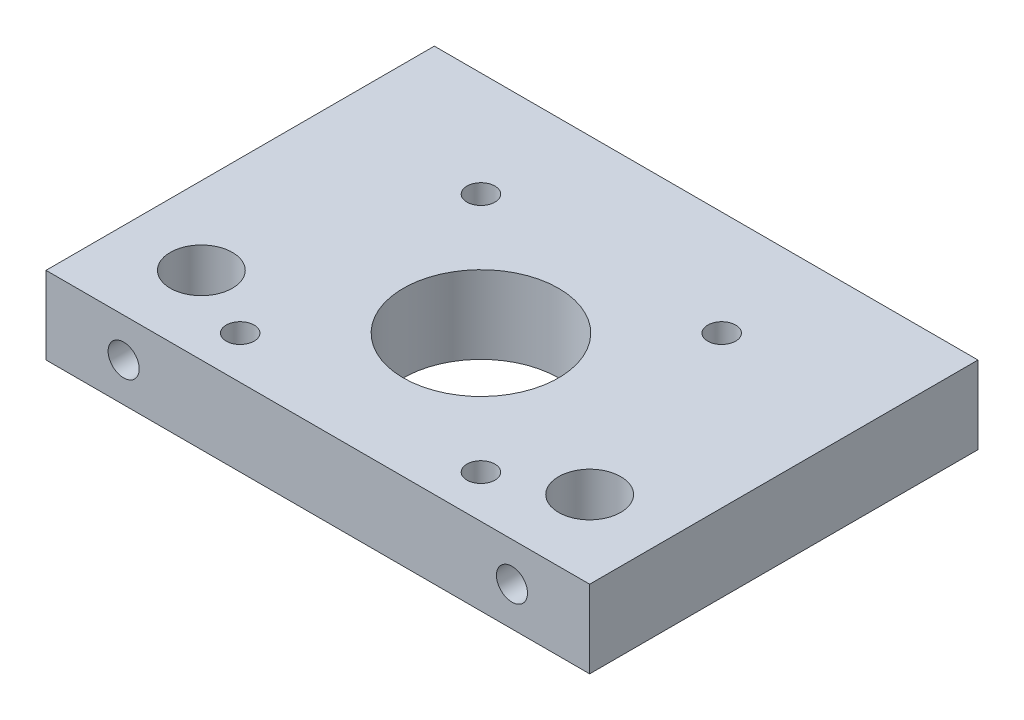
ISO-10303-21;
HEADER;
FILE_DESCRIPTION(('STEP AP214'),'2;1');
FILE_NAME('part.step','',(''),(''),'','','');
FILE_SCHEMA(('AUTOMOTIVE_DESIGN { 1 0 10303 214 1 1 1 1 }'));
ENDSEC;
DATA;
#1=APPLICATION_CONTEXT('core data for automotive mechanical design processes');
#2=APPLICATION_PROTOCOL_DEFINITION('international standard','automotive_design',2000,#1);
#3=PRODUCT_CONTEXT('',#1,'mechanical');
#4=PRODUCT('Part','Part','',(#3));
#5=PRODUCT_RELATED_PRODUCT_CATEGORY('part','',(#4));
#6=PRODUCT_DEFINITION_FORMATION('','',#4);
#7=PRODUCT_DEFINITION_CONTEXT('part definition',#1,'design');
#8=PRODUCT_DEFINITION('design','',#6,#7);
#9=PRODUCT_DEFINITION_SHAPE('','',#8);
#10=(LENGTH_UNIT() NAMED_UNIT(*) SI_UNIT(.MILLI.,.METRE.));
#11=(NAMED_UNIT(*) PLANE_ANGLE_UNIT() SI_UNIT($,.RADIAN.));
#12=(NAMED_UNIT(*) SI_UNIT($,.STERADIAN.) SOLID_ANGLE_UNIT());
#13=UNCERTAINTY_MEASURE_WITH_UNIT(LENGTH_MEASURE(1.E-05),#10,'distance_accuracy_value','');
#14=(GEOMETRIC_REPRESENTATION_CONTEXT(3) GLOBAL_UNCERTAINTY_ASSIGNED_CONTEXT((#13)) GLOBAL_UNIT_ASSIGNED_CONTEXT((#10,
#11,#12)) REPRESENTATION_CONTEXT('',''));
#15=CARTESIAN_POINT('',(0.,0.,0.));
#16=DIRECTION('',(0.,0.,1.));
#17=DIRECTION('',(1.,0.,0.));
#18=AXIS2_PLACEMENT_3D('',#15,#16,#17);
#19=CARTESIAN_POINT('',(-35.,10.,25.));
#20=DIRECTION('',(1.,0.,0.));
#21=DIRECTION('',(0.,0.,-1.));
#22=AXIS2_PLACEMENT_3D('',#19,#20,#21);
#23=PLANE('',#22);
#24=DIRECTION('',(0.,0.,1.));
#25=VECTOR('',#24,1.);
#26=CARTESIAN_POINT('',(-35.,0.,25.));
#27=LINE('',#26,#25);
#28=CARTESIAN_POINT('',(-35.,0.,-25.));
#29=VERTEX_POINT('',#28);
#30=CARTESIAN_POINT('',(-35.,0.,25.));
#31=VERTEX_POINT('',#30);
#32=EDGE_CURVE('E108',#29,#31,#27,.T.);
#33=ORIENTED_EDGE('',*,*,#32,.T.);
#34=DIRECTION('',(0.,-1.,0.));
#35=VECTOR('',#34,1.);
#36=CARTESIAN_POINT('',(-35.,10.,25.));
#37=LINE('',#36,#35);
#38=CARTESIAN_POINT('',(-35.,10.,25.));
#39=VERTEX_POINT('',#38);
#40=EDGE_CURVE('E11',#39,#31,#37,.T.);
#41=ORIENTED_EDGE('',*,*,#40,.F.);
#42=DIRECTION('',(0.,0.,1.));
#43=VECTOR('',#42,1.);
#44=CARTESIAN_POINT('',(-35.,10.,25.));
#45=LINE('',#44,#43);
#46=CARTESIAN_POINT('',(-35.,10.,-25.));
#47=VERTEX_POINT('',#46);
#48=EDGE_CURVE('E95',#47,#39,#45,.T.);
#49=ORIENTED_EDGE('',*,*,#48,.F.);
#50=DIRECTION('',(0.,-1.,0.));
#51=VECTOR('',#50,1.);
#52=CARTESIAN_POINT('',(-35.,10.,-25.));
#53=LINE('',#52,#51);
#54=EDGE_CURVE('E104',#47,#29,#53,.T.);
#55=ORIENTED_EDGE('',*,*,#54,.T.);
#56=EDGE_LOOP('',(#33,#41,#49,#55));
#57=FACE_BOUND('',#56,.T.);
#58=ADVANCED_FACE('F37',(#57),#23,.F.);
#59=CARTESIAN_POINT('',(35.,10.,25.));
#60=DIRECTION('',(0.,0.,-1.));
#61=DIRECTION('',(-1.,0.,0.));
#62=AXIS2_PLACEMENT_3D('',#59,#60,#61);
#63=PLANE('',#62);
#64=CARTESIAN_POINT('',(25.,5.,25.));
#65=DIRECTION('',(0.,0.,1.));
#66=DIRECTION('',(1.,0.,0.));
#67=AXIS2_PLACEMENT_3D('',#64,#65,#66);
#68=CIRCLE('',#67,2.);
#69=CARTESIAN_POINT('',(27.,5.,25.));
#70=VERTEX_POINT('',#69);
#71=EDGE_CURVE('E123',#70,#70,#68,.T.);
#72=ORIENTED_EDGE('',*,*,#71,.F.);
#73=EDGE_LOOP('',(#72));
#74=FACE_BOUND('',#73,.T.);
#75=CARTESIAN_POINT('',(-25.,4.99999999999999,25.));
#76=DIRECTION('',(0.,0.,1.));
#77=DIRECTION('',(-1.,0.,0.));
#78=AXIS2_PLACEMENT_3D('',#75,#76,#77);
#79=CIRCLE('',#78,2.);
#80=CARTESIAN_POINT('',(-27.,4.99999999999999,25.));
#81=VERTEX_POINT('',#80);
#82=EDGE_CURVE('E324',#81,#81,#79,.T.);
#83=ORIENTED_EDGE('',*,*,#82,.F.);
#84=EDGE_LOOP('',(#83));
#85=FACE_BOUND('',#84,.T.);
#86=DIRECTION('',(1.,0.,0.));
#87=VECTOR('',#86,1.);
#88=CARTESIAN_POINT('',(35.,0.,25.));
#89=LINE('',#88,#87);
#90=CARTESIAN_POINT('',(35.,0.,25.));
#91=VERTEX_POINT('',#90);
#92=EDGE_CURVE('E99',#31,#91,#89,.T.);
#93=ORIENTED_EDGE('',*,*,#92,.T.);
#94=DIRECTION('',(0.,-1.,0.));
#95=VECTOR('',#94,1.);
#96=CARTESIAN_POINT('',(35.,10.,25.));
#97=LINE('',#96,#95);
#98=CARTESIAN_POINT('',(35.,10.,25.));
#99=VERTEX_POINT('',#98);
#100=EDGE_CURVE('E51',#99,#91,#97,.T.);
#101=ORIENTED_EDGE('',*,*,#100,.F.);
#102=DIRECTION('',(1.,0.,0.));
#103=VECTOR('',#102,1.);
#104=CARTESIAN_POINT('',(35.,10.,25.));
#105=LINE('',#104,#103);
#106=EDGE_CURVE('E90',#39,#99,#105,.T.);
#107=ORIENTED_EDGE('',*,*,#106,.F.);
#108=ORIENTED_EDGE('',*,*,#40,.T.);
#109=EDGE_LOOP('',(#93,#101,#107,#108));
#110=FACE_BOUND('',#109,.T.);
#111=ADVANCED_FACE('F98',(#74,#85,#110),#63,.F.);
#112=CARTESIAN_POINT('',(35.,10.,25.));
#113=DIRECTION('',(-1.,0.,0.));
#114=DIRECTION('',(0.,0.,1.));
#115=AXIS2_PLACEMENT_3D('',#112,#113,#114);
#116=PLANE('',#115);
#117=DIRECTION('',(0.,0.,-1.));
#118=VECTOR('',#117,1.);
#119=CARTESIAN_POINT('',(35.,0.,25.));
#120=LINE('',#119,#118);
#121=CARTESIAN_POINT('',(35.,0.,-25.));
#122=VERTEX_POINT('',#121);
#123=EDGE_CURVE('E77',#91,#122,#120,.T.);
#124=ORIENTED_EDGE('',*,*,#123,.T.);
#125=DIRECTION('',(0.,-1.,0.));
#126=VECTOR('',#125,1.);
#127=CARTESIAN_POINT('',(35.,10.,-25.));
#128=LINE('',#127,#126);
#129=CARTESIAN_POINT('',(35.,10.,-25.));
#130=VERTEX_POINT('',#129);
#131=EDGE_CURVE('E100',#130,#122,#128,.T.);
#132=ORIENTED_EDGE('',*,*,#131,.F.);
#133=DIRECTION('',(0.,0.,-1.));
#134=VECTOR('',#133,1.);
#135=CARTESIAN_POINT('',(35.,10.,25.));
#136=LINE('',#135,#134);
#137=EDGE_CURVE('E93',#99,#130,#136,.T.);
#138=ORIENTED_EDGE('',*,*,#137,.F.);
#139=ORIENTED_EDGE('',*,*,#100,.T.);
#140=EDGE_LOOP('',(#124,#132,#138,#139));
#141=FACE_BOUND('',#140,.T.);
#142=ADVANCED_FACE('F102',(#141),#116,.F.);
#143=CARTESIAN_POINT('',(35.,10.,-25.));
#144=DIRECTION('',(0.,0.,1.));
#145=DIRECTION('',(1.,0.,0.));
#146=AXIS2_PLACEMENT_3D('',#143,#144,#145);
#147=PLANE('',#146);
#148=DIRECTION('',(-1.,0.,0.));
#149=VECTOR('',#148,1.);
#150=CARTESIAN_POINT('',(35.,0.,-25.));
#151=LINE('',#150,#149);
#152=EDGE_CURVE('E83',#122,#29,#151,.T.);
#153=ORIENTED_EDGE('',*,*,#152,.T.);
#154=ORIENTED_EDGE('',*,*,#54,.F.);
#155=DIRECTION('',(-1.,0.,0.));
#156=VECTOR('',#155,1.);
#157=CARTESIAN_POINT('',(35.,10.,-25.));
#158=LINE('',#157,#156);
#159=EDGE_CURVE('E60',#130,#47,#158,.T.);
#160=ORIENTED_EDGE('',*,*,#159,.F.);
#161=ORIENTED_EDGE('',*,*,#131,.T.);
#162=EDGE_LOOP('',(#153,#154,#160,#161));
#163=FACE_BOUND('',#162,.T.);
#164=ADVANCED_FACE('F176',(#163),#147,.F.);
#165=CARTESIAN_POINT('',(0.,10.,0.));
#166=DIRECTION('',(0.,1.,0.));
#167=DIRECTION('',(0.,0.,1.));
#168=AXIS2_PLACEMENT_3D('',#165,#166,#167);
#169=PLANE('',#168);
#170=CARTESIAN_POINT('',(5.15281762734335E-13,10.,4.));
#171=DIRECTION('',(0.,-1.,0.));
#172=DIRECTION('',(0.,0.,-1.));
#173=AXIS2_PLACEMENT_3D('',#170,#171,#172);
#174=CIRCLE('',#173,10.);
#175=CARTESIAN_POINT('',(5.15281762734335E-13,10.,-6.00000000000001));
#176=VERTEX_POINT('',#175);
#177=EDGE_CURVE('E254',#176,#176,#174,.T.);
#178=ORIENTED_EDGE('',*,*,#177,.T.);
#179=EDGE_LOOP('',(#178));
#180=FACE_BOUND('',#179,.T.);
#181=CARTESIAN_POINT('',(15.5000000000005,10.,19.5));
#182=DIRECTION('',(0.,-1.,0.));
#183=DIRECTION('',(0.,0.,-1.));
#184=AXIS2_PLACEMENT_3D('',#181,#182,#183);
#185=CIRCLE('',#184,1.80000000000002);
#186=CARTESIAN_POINT('',(15.5000000000005,10.,17.7));
#187=VERTEX_POINT('',#186);
#188=EDGE_CURVE('E275',#187,#187,#185,.T.);
#189=ORIENTED_EDGE('',*,*,#188,.T.);
#190=EDGE_LOOP('',(#189));
#191=FACE_BOUND('',#190,.T.);
#192=CARTESIAN_POINT('',(15.5000000000005,10.,-11.5));
#193=DIRECTION('',(0.,-1.,0.));
#194=DIRECTION('',(0.,0.,-1.));
#195=AXIS2_PLACEMENT_3D('',#192,#193,#194);
#196=CIRCLE('',#195,1.80000000000002);
#197=CARTESIAN_POINT('',(15.5000000000005,10.,-13.3));
#198=VERTEX_POINT('',#197);
#199=EDGE_CURVE('E269',#198,#198,#196,.T.);
#200=ORIENTED_EDGE('',*,*,#199,.T.);
#201=EDGE_LOOP('',(#200));
#202=FACE_BOUND('',#201,.T.);
#203=CARTESIAN_POINT('',(-15.4999999999995,10.,-11.5));
#204=DIRECTION('',(0.,-1.,0.));
#205=DIRECTION('',(0.,0.,-1.));
#206=AXIS2_PLACEMENT_3D('',#203,#204,#205);
#207=CIRCLE('',#206,1.80000000000002);
#208=CARTESIAN_POINT('',(-15.4999999999995,10.,-13.3));
#209=VERTEX_POINT('',#208);
#210=EDGE_CURVE('E262',#209,#209,#207,.T.);
#211=ORIENTED_EDGE('',*,*,#210,.T.);
#212=EDGE_LOOP('',(#211));
#213=FACE_BOUND('',#212,.T.);
#214=CARTESIAN_POINT('',(-15.4999999999995,10.,19.5));
#215=DIRECTION('',(0.,-1.,0.));
#216=DIRECTION('',(0.,0.,-1.));
#217=AXIS2_PLACEMENT_3D('',#214,#215,#216);
#218=CIRCLE('',#217,1.80000000000002);
#219=CARTESIAN_POINT('',(-15.4999999999995,10.,17.7));
#220=VERTEX_POINT('',#219);
#221=EDGE_CURVE('E280',#220,#220,#218,.T.);
#222=ORIENTED_EDGE('',*,*,#221,.T.);
#223=EDGE_LOOP('',(#222));
#224=FACE_BOUND('',#223,.T.);
#225=CARTESIAN_POINT('',(-25.,10.,15.));
#226=DIRECTION('',(0.,1.,0.));
#227=DIRECTION('',(0.,0.,1.));
#228=AXIS2_PLACEMENT_3D('',#225,#226,#227);
#229=CIRCLE('',#228,4.);
#230=CARTESIAN_POINT('',(-25.,10.,19.));
#231=VERTEX_POINT('',#230);
#232=EDGE_CURVE('E288',#231,#231,#229,.T.);
#233=ORIENTED_EDGE('',*,*,#232,.F.);
#234=EDGE_LOOP('',(#233));
#235=FACE_BOUND('',#234,.T.);
#236=CARTESIAN_POINT('',(25.,10.,15.));
#237=DIRECTION('',(0.,1.,0.));
#238=DIRECTION('',(0.,0.,-1.));
#239=AXIS2_PLACEMENT_3D('',#236,#237,#238);
#240=CIRCLE('',#239,4.);
#241=CARTESIAN_POINT('',(25.,10.,11.));
#242=VERTEX_POINT('',#241);
#243=EDGE_CURVE('E283',#242,#242,#240,.T.);
#244=ORIENTED_EDGE('',*,*,#243,.F.);
#245=EDGE_LOOP('',(#244));
#246=FACE_BOUND('',#245,.T.);
#247=ORIENTED_EDGE('',*,*,#48,.T.);
#248=ORIENTED_EDGE('',*,*,#106,.T.);
#249=ORIENTED_EDGE('',*,*,#137,.T.);
#250=ORIENTED_EDGE('',*,*,#159,.T.);
#251=EDGE_LOOP('',(#247,#248,#249,#250));
#252=FACE_BOUND('',#251,.T.);
#253=ADVANCED_FACE('F91',(#180,#191,#202,#213,#224,#235,#246,#252),#169,.T.);
#254=CARTESIAN_POINT('',(0.,0.,0.));
#255=DIRECTION('',(0.,1.,0.));
#256=DIRECTION('',(0.,0.,1.));
#257=AXIS2_PLACEMENT_3D('',#254,#255,#256);
#258=PLANE('',#257);
#259=CARTESIAN_POINT('',(5.15281762734335E-13,0.,4.));
#260=DIRECTION('',(0.,-1.,0.));
#261=DIRECTION('',(0.,0.,-1.));
#262=AXIS2_PLACEMENT_3D('',#259,#260,#261);
#263=CIRCLE('',#262,10.);
#264=CARTESIAN_POINT('',(5.15281762734335E-13,0.,-6.00000000000001));
#265=VERTEX_POINT('',#264);
#266=EDGE_CURVE('E252',#265,#265,#263,.T.);
#267=ORIENTED_EDGE('',*,*,#266,.F.);
#268=EDGE_LOOP('',(#267));
#269=FACE_BOUND('',#268,.T.);
#270=CARTESIAN_POINT('',(15.5000000000005,0.,19.5));
#271=DIRECTION('',(0.,-1.,0.));
#272=DIRECTION('',(0.,0.,-1.));
#273=AXIS2_PLACEMENT_3D('',#270,#271,#272);
#274=CIRCLE('',#273,1.80000000000002);
#275=CARTESIAN_POINT('',(15.5000000000005,0.,17.7));
#276=VERTEX_POINT('',#275);
#277=EDGE_CURVE('E258',#276,#276,#274,.T.);
#278=ORIENTED_EDGE('',*,*,#277,.F.);
#279=EDGE_LOOP('',(#278));
#280=FACE_BOUND('',#279,.T.);
#281=CARTESIAN_POINT('',(15.5000000000005,0.,-11.5));
#282=DIRECTION('',(0.,-1.,0.));
#283=DIRECTION('',(0.,0.,-1.));
#284=AXIS2_PLACEMENT_3D('',#281,#282,#283);
#285=CIRCLE('',#284,1.80000000000002);
#286=CARTESIAN_POINT('',(15.5000000000005,0.,-13.3));
#287=VERTEX_POINT('',#286);
#288=EDGE_CURVE('E272',#287,#287,#285,.T.);
#289=ORIENTED_EDGE('',*,*,#288,.F.);
#290=EDGE_LOOP('',(#289));
#291=FACE_BOUND('',#290,.T.);
#292=CARTESIAN_POINT('',(-15.4999999999995,0.,-11.5));
#293=DIRECTION('',(0.,-1.,0.));
#294=DIRECTION('',(0.,0.,-1.));
#295=AXIS2_PLACEMENT_3D('',#292,#293,#294);
#296=CIRCLE('',#295,1.80000000000002);
#297=CARTESIAN_POINT('',(-15.4999999999995,0.,-13.3));
#298=VERTEX_POINT('',#297);
#299=EDGE_CURVE('E266',#298,#298,#296,.T.);
#300=ORIENTED_EDGE('',*,*,#299,.F.);
#301=EDGE_LOOP('',(#300));
#302=FACE_BOUND('',#301,.T.);
#303=CARTESIAN_POINT('',(-15.4999999999995,0.,19.5));
#304=DIRECTION('',(0.,-1.,0.));
#305=DIRECTION('',(0.,0.,-1.));
#306=AXIS2_PLACEMENT_3D('',#303,#304,#305);
#307=CIRCLE('',#306,1.80000000000002);
#308=CARTESIAN_POINT('',(-15.4999999999995,0.,17.7));
#309=VERTEX_POINT('',#308);
#310=EDGE_CURVE('E265',#309,#309,#307,.T.);
#311=ORIENTED_EDGE('',*,*,#310,.F.);
#312=EDGE_LOOP('',(#311));
#313=FACE_BOUND('',#312,.T.);
#314=CARTESIAN_POINT('',(-25.,0.,15.));
#315=DIRECTION('',(0.,1.,0.));
#316=DIRECTION('',(0.,0.,1.));
#317=AXIS2_PLACEMENT_3D('',#314,#315,#316);
#318=CIRCLE('',#317,4.);
#319=CARTESIAN_POINT('',(-25.,0.,19.));
#320=VERTEX_POINT('',#319);
#321=EDGE_CURVE('E111',#320,#320,#318,.T.);
#322=ORIENTED_EDGE('',*,*,#321,.T.);
#323=EDGE_LOOP('',(#322));
#324=FACE_BOUND('',#323,.T.);
#325=CARTESIAN_POINT('',(25.,0.,15.));
#326=DIRECTION('',(0.,1.,0.));
#327=DIRECTION('',(0.,0.,-1.));
#328=AXIS2_PLACEMENT_3D('',#325,#326,#327);
#329=CIRCLE('',#328,4.);
#330=CARTESIAN_POINT('',(25.,0.,11.));
#331=VERTEX_POINT('',#330);
#332=EDGE_CURVE('E291',#331,#331,#329,.T.);
#333=ORIENTED_EDGE('',*,*,#332,.T.);
#334=EDGE_LOOP('',(#333));
#335=FACE_BOUND('',#334,.T.);
#336=ORIENTED_EDGE('',*,*,#32,.F.);
#337=ORIENTED_EDGE('',*,*,#152,.F.);
#338=ORIENTED_EDGE('',*,*,#123,.F.);
#339=ORIENTED_EDGE('',*,*,#92,.F.);
#340=EDGE_LOOP('',(#336,#337,#338,#339));
#341=FACE_BOUND('',#340,.T.);
#342=ADVANCED_FACE('F167',(#269,#280,#291,#302,#313,#324,#335,#341),#258,.F.);
#343=CARTESIAN_POINT('',(25.,0.,15.));
#344=DIRECTION('',(0.,1.,0.));
#345=DIRECTION('',(0.,0.,1.));
#346=AXIS2_PLACEMENT_3D('',#343,#344,#345);
#347=CYLINDRICAL_SURFACE('',#346,4.);
#348=CARTESIAN_POINT('',(25.,3.,19.));
#349=CARTESIAN_POINT('',(25.1051439259025,3.00000660463439,18.9999942681008));
#350=CARTESIAN_POINT('',(25.2104131993951,3.00834014624211,18.9958098203951));
#351=CARTESIAN_POINT('',(25.4178404705378,3.04130576068308,18.9794831207431));
#352=CARTESIAN_POINT('',(25.5199921734273,3.06596878599564,18.9673257565784));
#353=CARTESIAN_POINT('',(25.7178670897609,3.13038761723326,18.9363255880675));
#354=CARTESIAN_POINT('',(25.8136136058783,3.17008476849594,18.9175087835507));
#355=CARTESIAN_POINT('',(25.9969452336132,3.26314124272997,18.8749155303152));
#356=CARTESIAN_POINT('',(26.0845309879801,3.31649948849773,18.8511394726705));
#357=CARTESIAN_POINT('',(26.2550156355238,3.43903449897058,18.7991251651612));
#358=CARTESIAN_POINT('',(26.3373104222442,3.50897295847928,18.7707039825507));
#359=CARTESIAN_POINT('',(26.489558889734,3.66104295849408,18.7131994049349));
#360=CARTESIAN_POINT('',(26.5595031662135,3.74318370354489,18.6841155241807));
#361=CARTESIAN_POINT('',(26.6905040009006,3.92496669904677,18.625979023947));
#362=CARTESIAN_POINT('',(26.7504506711033,4.02547219669183,18.5971037394026));
#363=CARTESIAN_POINT('',(26.8523364537814,4.23673467197244,18.5457195754464));
#364=CARTESIAN_POINT('',(26.8942884299327,4.34748425744551,18.5232061521398));
#365=CARTESIAN_POINT('',(26.9562648843772,4.56933021084385,18.4891573407562));
#366=CARTESIAN_POINT('',(26.9774517141609,4.6800089041348,18.4770454316743));
#367=CARTESIAN_POINT('',(27.0008539866177,4.90395767555896,18.4636377989706));
#368=CARTESIAN_POINT('',(27.0030881767462,5.01722508174232,18.4623313868658));
#369=CARTESIAN_POINT('',(26.9893745743446,5.22857204863074,18.470218605145));
#370=CARTESIAN_POINT('',(26.9755691190736,5.32684806244611,18.4781752732403));
#371=CARTESIAN_POINT('',(26.9338796981139,5.51944381874609,18.501524574677));
#372=CARTESIAN_POINT('',(26.9059912477953,5.61376229061064,18.5169195766355));
#373=CARTESIAN_POINT('',(26.836419560772,5.79845826513133,18.5537495282548));
#374=CARTESIAN_POINT('',(26.794430134232,5.88869279757159,18.57531681328));
#375=CARTESIAN_POINT('',(26.698083375336,6.06126858518002,18.6220680856281));
#376=CARTESIAN_POINT('',(26.6437204876249,6.14360627120019,18.6472536956038));
#377=CARTESIAN_POINT('',(26.5161321098256,6.30904250548646,18.7022631580657));
#378=CARTESIAN_POINT('',(26.4413889167386,6.39091374715232,18.7322702047349));
#379=CARTESIAN_POINT('',(26.2791111574827,6.54147083718181,18.7909524660082));
#380=CARTESIAN_POINT('',(26.1915705131486,6.61015038406777,18.819627039176));
#381=CARTESIAN_POINT('',(26.0010330116637,6.73537132205946,18.8740397456593));
#382=CARTESIAN_POINT('',(25.8975071831988,6.79120094489148,18.8995796832401));
#383=CARTESIAN_POINT('',(25.6809324309776,6.88419405808602,18.9431576224248));
#384=CARTESIAN_POINT('',(25.5678911525305,6.92137237003034,18.9612015788711));
#385=CARTESIAN_POINT('',(25.3455329833214,6.97295080743335,18.9864866748287));
#386=CARTESIAN_POINT('',(25.2366830610966,6.98898247149356,18.9944987660262));
#387=CARTESIAN_POINT('',(25.0175591998987,7.00292946226897,19.0014602691821));
#388=CARTESIAN_POINT('',(24.9072859602602,7.00085337127894,19.0004139744264));
#389=CARTESIAN_POINT('',(24.697534056028,6.97958662316251,18.9898238450687));
#390=CARTESIAN_POINT('',(24.5978811839001,6.96173493454001,18.9809449137634));
#391=CARTESIAN_POINT('',(24.4031862153961,6.91152385620975,18.9564434262968));
#392=CARTESIAN_POINT('',(24.3081446286178,6.87916286709301,18.9408201266882));
#393=CARTESIAN_POINT('',(24.1222227831008,6.80000306713393,18.9036850282718));
#394=CARTESIAN_POINT('',(24.0315392059884,6.75281789976742,18.8820176353926));
#395=CARTESIAN_POINT('',(23.8590772766015,6.64578492870686,18.8348794863483));
#396=CARTESIAN_POINT('',(23.7773027404468,6.5859317308092,18.8094071113388));
#397=CARTESIAN_POINT('',(23.6164646214216,6.44847914933856,18.754164426724));
#398=CARTESIAN_POINT('',(23.5384558443619,6.3697142631097,18.72421769687));
#399=CARTESIAN_POINT('',(23.3962873577623,6.20014969744454,18.6652478321764));
#400=CARTESIAN_POINT('',(23.3321372285763,6.10934176230415,18.6362253480009));
#401=CARTESIAN_POINT('',(23.216584171042,5.91271269165404,18.5810238441298));
#402=CARTESIAN_POINT('',(23.1659490083995,5.80637746781103,18.5550505917812));
#403=CARTESIAN_POINT('',(23.0838343481306,5.58497986485006,18.5114814458827));
#404=CARTESIAN_POINT('',(23.052330168266,5.46992894706621,18.493874764435));
#405=CARTESIAN_POINT('',(23.0122766250663,5.24617955423058,18.471230020516));
#406=CARTESIAN_POINT('',(23.0018140071891,5.13793149312951,18.4651476693013));
#407=CARTESIAN_POINT('',(22.9986216912476,4.92110586567094,18.4633070928321));
#408=CARTESIAN_POINT('',(23.0058843067535,4.81252846252427,18.4675443925278));
#409=CARTESIAN_POINT('',(23.0361477488134,4.60903299693312,18.4847572410215));
#410=CARTESIAN_POINT('',(23.0575833713139,4.51379905971051,18.4968618896532));
#411=CARTESIAN_POINT('',(23.1136492835512,4.32838376115126,18.527420323753));
#412=CARTESIAN_POINT('',(23.1482838176802,4.23820403581593,18.5458761513934));
#413=CARTESIAN_POINT('',(23.2323685093989,4.05875029802692,18.5885706072907));
#414=CARTESIAN_POINT('',(23.2826577243686,3.96994419634194,18.6131144479184));
#415=CARTESIAN_POINT('',(23.3956980567252,3.80145092763748,18.6647066326972));
#416=CARTESIAN_POINT('',(23.4584556575169,3.72176853895777,18.6917562759122));
#417=CARTESIAN_POINT('',(23.6035933466773,3.56371603529064,18.7492464631618));
#418=CARTESIAN_POINT('',(23.6874311540055,3.48668179529941,18.7796996661326));
#419=CARTESIAN_POINT('',(23.8676903875336,3.34747403312946,18.8375550451986));
#420=CARTESIAN_POINT('',(23.9641185533896,3.28530852106018,18.8649555725239));
#421=CARTESIAN_POINT('',(24.1681368064341,3.17752727457586,18.9139601913307));
#422=CARTESIAN_POINT('',(24.2758009924466,3.13203166152706,18.9355219298787));
#423=CARTESIAN_POINT('',(24.4985157977238,3.06038366448518,18.9700268259797));
#424=CARTESIAN_POINT('',(24.6135444008218,3.03417630638857,18.9829944672614));
#425=CARTESIAN_POINT('',(24.7747961070182,3.01220517782852,18.9939092382696));
#426=CARTESIAN_POINT('',(24.8196762411169,3.00763471826732,18.996187306805));
#427=CARTESIAN_POINT('',(24.9096965363898,3.00153066897183,18.9992339395363));
#428=CARTESIAN_POINT('',(24.9548367047068,2.99999716305958,19.0000024620676));
#429=CARTESIAN_POINT('',(25.,3.,19.));
#430=B_SPLINE_CURVE_WITH_KNOTS('',3,(#348,#349,#350,#351,#352,#353,#354,#355,#356,#357,#358,
#359,#360,#361,#362,#363,#364,#365,#366,#367,#368,#369,#370,#371,#372,#373,#374,#375,#376,#377,
#378,#379,#380,#381,#382,#383,#384,#385,#386,#387,#388,#389,#390,#391,#392,#393,#394,#395,#396,
#397,#398,#399,#400,#401,#402,#403,#404,#405,#406,#407,#408,#409,#410,#411,#412,#413,#414,#415,
#416,#417,#418,#419,#420,#421,#422,#423,#424,#425,#426,#427,#428,#429),.UNSPECIFIED.,.T.,.F.,(4,
2,2,2,2,2,2,2,2,2,2,2,2,2,2,2,2,2,2,2,2,2,2,2,2,2,2,2,2,2,2,2,2,2,2,2,2,2,2,2,4),(0.,
0.315248514840586,0.631096299418395,0.945724310984595,1.26032752116313,1.59396351743618,
1.92785247530807,2.28763452861505,2.64715895796561,2.98516024280459,3.3228271465804,
3.62011424818641,3.91749607851356,4.22180480336974,4.52625042520443,4.86929882667757,
5.21251069197373,5.57166044428881,5.93052433824559,6.25966580942691,6.58865129022951,
6.89213813012243,7.19565843261863,7.50785712055797,7.82018901496678,8.16319221288837,
8.50643177230863,8.86629364323451,9.22569023890901,9.55058615006092,9.87534119729356,
10.1691586049771,10.463070575767,10.7767291356057,11.0905512228726,11.4425048551434,
11.7946476676249,12.1492802732705,12.502898172423,12.6383056026783,12.7737167702213),.UNSPECIFIED.);
#431=CARTESIAN_POINT('',(25.,3.,19.));
#432=VERTEX_POINT('',#431);
#433=EDGE_CURVE('E40',#432,#432,#430,.T.);
#434=ORIENTED_EDGE('',*,*,#433,.T.);
#435=EDGE_LOOP('',(#434));
#436=FACE_BOUND('',#435,.T.);
#437=ORIENTED_EDGE('',*,*,#332,.F.);
#438=EDGE_LOOP('',(#437));
#439=FACE_BOUND('',#438,.T.);
#440=ORIENTED_EDGE('',*,*,#243,.T.);
#441=EDGE_LOOP('',(#440));
#442=FACE_BOUND('',#441,.T.);
#443=ADVANCED_FACE('F155',(#436,#439,#442),#347,.F.);
#444=CARTESIAN_POINT('',(-25.,0.,15.));
#445=DIRECTION('',(0.,1.,0.));
#446=DIRECTION('',(0.,0.,1.));
#447=AXIS2_PLACEMENT_3D('',#444,#445,#446);
#448=CYLINDRICAL_SURFACE('',#447,4.);
#449=CARTESIAN_POINT('',(-25.,3.,19.));
#450=CARTESIAN_POINT('',(-24.8948560740975,3.00000660463438,18.9999942681008));
#451=CARTESIAN_POINT('',(-24.7895868006049,3.00834014624211,18.9958098203951));
#452=CARTESIAN_POINT('',(-24.5821595294622,3.04130576068307,18.9794831207431));
#453=CARTESIAN_POINT('',(-24.4800078265727,3.06596878599563,18.9673257565784));
#454=CARTESIAN_POINT('',(-24.2821329102391,3.13038761723325,18.9363255880675));
#455=CARTESIAN_POINT('',(-24.1863863941217,3.17008476849593,18.9175087835508));
#456=CARTESIAN_POINT('',(-24.0030547663868,3.26314124272997,18.8749155303152));
#457=CARTESIAN_POINT('',(-23.9154690120199,3.31649948849772,18.8511394726705));
#458=CARTESIAN_POINT('',(-23.7449843644762,3.43903449897057,18.7991251651612));
#459=CARTESIAN_POINT('',(-23.6626895777558,3.50897295847927,18.7707039825507));
#460=CARTESIAN_POINT('',(-23.510441110266,3.66104295849407,18.7131994049349));
#461=CARTESIAN_POINT('',(-23.4404968337865,3.74318370354487,18.6841155241807));
#462=CARTESIAN_POINT('',(-23.3094959990994,3.92496669904675,18.625979023947));
#463=CARTESIAN_POINT('',(-23.2495493288967,4.02547219669182,18.5971037394026));
#464=CARTESIAN_POINT('',(-23.1476635462186,4.23673467197242,18.5457195754464));
#465=CARTESIAN_POINT('',(-23.1057115700673,4.34748425744549,18.5232061521398));
#466=CARTESIAN_POINT('',(-23.0437351156228,4.56933021084384,18.4891573407562));
#467=CARTESIAN_POINT('',(-23.0225482858391,4.68000890413478,18.4770454316743));
#468=CARTESIAN_POINT('',(-22.9991460133823,4.90395767555895,18.4636377989706));
#469=CARTESIAN_POINT('',(-22.9969118232539,5.0172250817423,18.4623313868658));
#470=CARTESIAN_POINT('',(-23.0106254256554,5.22857204863073,18.470218605145));
#471=CARTESIAN_POINT('',(-23.0244308809264,5.32684806244609,18.4781752732403));
#472=CARTESIAN_POINT('',(-23.0661203018861,5.51944381874607,18.501524574677));
#473=CARTESIAN_POINT('',(-23.0940087522047,5.61376229061062,18.5169195766355));
#474=CARTESIAN_POINT('',(-23.163580439228,5.79845826513131,18.5537495282548));
#475=CARTESIAN_POINT('',(-23.205569865768,5.88869279757157,18.57531681328));
#476=CARTESIAN_POINT('',(-23.301916624664,6.06126858518,18.6220680856281));
#477=CARTESIAN_POINT('',(-23.3562795123751,6.14360627120017,18.6472536956038));
#478=CARTESIAN_POINT('',(-23.4838678901744,6.30904250548644,18.7022631580657));
#479=CARTESIAN_POINT('',(-23.5586110832614,6.3909137471523,18.7322702047349));
#480=CARTESIAN_POINT('',(-23.7208888425173,6.54147083718179,18.7909524660082));
#481=CARTESIAN_POINT('',(-23.8084294868514,6.61015038406776,18.819627039176));
#482=CARTESIAN_POINT('',(-23.9989669883363,6.73537132205944,18.8740397456593));
#483=CARTESIAN_POINT('',(-24.1024928168012,6.79120094489147,18.8995796832401));
#484=CARTESIAN_POINT('',(-24.3190675690224,6.88419405808601,18.9431576224248));
#485=CARTESIAN_POINT('',(-24.4321088474694,6.92137237003032,18.9612015788711));
#486=CARTESIAN_POINT('',(-24.6544670166786,6.97295080743334,18.9864866748287));
#487=CARTESIAN_POINT('',(-24.7633169389033,6.98898247149355,18.9944987660262));
#488=CARTESIAN_POINT('',(-24.9824408001013,7.00292946226896,19.0014602691821));
#489=CARTESIAN_POINT('',(-25.0927140397398,7.00085337127893,19.0004139744264));
#490=CARTESIAN_POINT('',(-25.302465943972,6.9795866231625,18.9898238450687));
#491=CARTESIAN_POINT('',(-25.4021188160999,6.96173493454,18.9809449137634));
#492=CARTESIAN_POINT('',(-25.5968137846039,6.91152385620975,18.9564434262968));
#493=CARTESIAN_POINT('',(-25.6918553713822,6.879162867093,18.9408201266882));
#494=CARTESIAN_POINT('',(-25.8777772168991,6.80000306713393,18.9036850282718));
#495=CARTESIAN_POINT('',(-25.9684607940116,6.75281789976742,18.8820176353926));
#496=CARTESIAN_POINT('',(-26.1409227233985,6.64578492870686,18.8348794863484));
#497=CARTESIAN_POINT('',(-26.2226972595532,6.5859317308092,18.8094071113388));
#498=CARTESIAN_POINT('',(-26.3835353785784,6.44847914933856,18.754164426724));
#499=CARTESIAN_POINT('',(-26.461544155638,6.3697142631097,18.72421769687));
#500=CARTESIAN_POINT('',(-26.6037126422377,6.20014969744454,18.6652478321764));
#501=CARTESIAN_POINT('',(-26.6678627714237,6.10934176230415,18.6362253480009));
#502=CARTESIAN_POINT('',(-26.783415828958,5.91271269165404,18.5810238441298));
#503=CARTESIAN_POINT('',(-26.8340509916005,5.80637746781103,18.5550505917812));
#504=CARTESIAN_POINT('',(-26.9161656518694,5.58497986485006,18.5114814458827));
#505=CARTESIAN_POINT('',(-26.947669831734,5.46992894706622,18.493874764435));
#506=CARTESIAN_POINT('',(-26.9877233749337,5.24617955423059,18.471230020516));
#507=CARTESIAN_POINT('',(-26.9981859928109,5.13793149312951,18.4651476693013));
#508=CARTESIAN_POINT('',(-27.0013783087524,4.92110586567095,18.4633070928321));
#509=CARTESIAN_POINT('',(-26.9941156932465,4.81252846252427,18.4675443925278));
#510=CARTESIAN_POINT('',(-26.9638522511866,4.60903299693312,18.4847572410215));
#511=CARTESIAN_POINT('',(-26.9424166286861,4.51379905971052,18.4968618896532));
#512=CARTESIAN_POINT('',(-26.8863507164488,4.32838376115126,18.5274203237531));
#513=CARTESIAN_POINT('',(-26.8517161823198,4.23820403581593,18.5458761513934));
#514=CARTESIAN_POINT('',(-26.7676314906011,4.05875029802692,18.5885706072907));
#515=CARTESIAN_POINT('',(-26.7173422756314,3.96994419634194,18.6131144479184));
#516=CARTESIAN_POINT('',(-26.6043019432748,3.80145092763748,18.6647066326972));
#517=CARTESIAN_POINT('',(-26.5415443424831,3.72176853895778,18.6917562759122));
#518=CARTESIAN_POINT('',(-26.3964066533227,3.56371603529065,18.7492464631618));
#519=CARTESIAN_POINT('',(-26.3125688459945,3.48668179529942,18.7796996661326));
#520=CARTESIAN_POINT('',(-26.1323096124664,3.34747403312946,18.8375550451986));
#521=CARTESIAN_POINT('',(-26.0358814466104,3.28530852106019,18.8649555725239));
#522=CARTESIAN_POINT('',(-25.8318631935659,3.17752727457586,18.9139601913308));
#523=CARTESIAN_POINT('',(-25.7241990075535,3.13203166152706,18.9355219298787));
#524=CARTESIAN_POINT('',(-25.5014842022762,3.06038366448518,18.9700268259797));
#525=CARTESIAN_POINT('',(-25.3864555991782,3.03417630638857,18.9829944672614));
#526=CARTESIAN_POINT('',(-25.2252038929818,3.01220517782852,18.9939092382696));
#527=CARTESIAN_POINT('',(-25.1803237588831,3.00763471826732,18.996187306805));
#528=CARTESIAN_POINT('',(-25.0903034636102,3.00153066897183,18.9992339395363));
#529=CARTESIAN_POINT('',(-25.0451632952933,2.99999716305958,19.0000024620676));
#530=CARTESIAN_POINT('',(-25.,3.,19.));
#531=B_SPLINE_CURVE_WITH_KNOTS('',3,(#449,#450,#451,#452,#453,#454,#455,#456,#457,#458,#459,
#460,#461,#462,#463,#464,#465,#466,#467,#468,#469,#470,#471,#472,#473,#474,#475,#476,#477,#478,
#479,#480,#481,#482,#483,#484,#485,#486,#487,#488,#489,#490,#491,#492,#493,#494,#495,#496,#497,
#498,#499,#500,#501,#502,#503,#504,#505,#506,#507,#508,#509,#510,#511,#512,#513,#514,#515,#516,
#517,#518,#519,#520,#521,#522,#523,#524,#525,#526,#527,#528,#529,#530),.UNSPECIFIED.,.T.,.F.,(4,
2,2,2,2,2,2,2,2,2,2,2,2,2,2,2,2,2,2,2,2,2,2,2,2,2,2,2,2,2,2,2,2,2,2,2,2,2,2,2,4),(0.,
0.315248514840582,0.631096299418394,0.945724310984594,1.26032752116313,1.59396351743617,
1.92785247530806,2.28763452861505,2.64715895796561,2.98516024280459,3.3228271465804,
3.6201142481864,3.91749607851356,4.22180480336974,4.52625042520443,4.86929882667756,
5.21251069197372,5.5716604442888,5.93052433824558,6.2596658094269,6.5886512902295,
6.89213813012242,7.19565843261861,7.50785712055795,7.82018901496677,8.16319221288836,
8.50643177230862,8.86629364323449,9.22569023890899,9.55058615006091,9.87534119729355,
10.1691586049771,10.463070575767,10.7767291356057,11.0905512228726,11.4425048551434,
11.7946476676249,12.1492802732705,12.502898172423,12.6383056026783,12.7737167702213),.UNSPECIFIED.);
#532=CARTESIAN_POINT('',(-25.,3.,19.));
#533=VERTEX_POINT('',#532);
#534=EDGE_CURVE('E116',#533,#533,#531,.T.);
#535=ORIENTED_EDGE('',*,*,#534,.T.);
#536=EDGE_LOOP('',(#535));
#537=FACE_BOUND('',#536,.T.);
#538=ORIENTED_EDGE('',*,*,#321,.F.);
#539=EDGE_LOOP('',(#538));
#540=FACE_BOUND('',#539,.T.);
#541=ORIENTED_EDGE('',*,*,#232,.T.);
#542=EDGE_LOOP('',(#541));
#543=FACE_BOUND('',#542,.T.);
#544=ADVANCED_FACE('F124',(#537,#540,#543),#448,.F.);
#545=CARTESIAN_POINT('',(-15.4999999999995,10.,19.5));
#546=DIRECTION('',(0.,-1.,0.));
#547=DIRECTION('',(0.,0.,-1.));
#548=AXIS2_PLACEMENT_3D('',#545,#546,#547);
#549=CYLINDRICAL_SURFACE('',#548,1.80000000000002);
#550=ORIENTED_EDGE('',*,*,#221,.F.);
#551=EDGE_LOOP('',(#550));
#552=FACE_BOUND('',#551,.T.);
#553=ORIENTED_EDGE('',*,*,#310,.T.);
#554=EDGE_LOOP('',(#553));
#555=FACE_BOUND('',#554,.T.);
#556=ADVANCED_FACE('F143',(#552,#555),#549,.F.);
#557=CARTESIAN_POINT('',(-15.4999999999995,10.,-11.5));
#558=DIRECTION('',(0.,-1.,0.));
#559=DIRECTION('',(0.,0.,-1.));
#560=AXIS2_PLACEMENT_3D('',#557,#558,#559);
#561=CYLINDRICAL_SURFACE('',#560,1.80000000000002);
#562=ORIENTED_EDGE('',*,*,#210,.F.);
#563=EDGE_LOOP('',(#562));
#564=FACE_BOUND('',#563,.T.);
#565=ORIENTED_EDGE('',*,*,#299,.T.);
#566=EDGE_LOOP('',(#565));
#567=FACE_BOUND('',#566,.T.);
#568=ADVANCED_FACE('F139',(#564,#567),#561,.F.);
#569=CARTESIAN_POINT('',(15.5000000000005,10.,-11.5));
#570=DIRECTION('',(0.,-1.,0.));
#571=DIRECTION('',(0.,0.,-1.));
#572=AXIS2_PLACEMENT_3D('',#569,#570,#571);
#573=CYLINDRICAL_SURFACE('',#572,1.80000000000002);
#574=ORIENTED_EDGE('',*,*,#199,.F.);
#575=EDGE_LOOP('',(#574));
#576=FACE_BOUND('',#575,.T.);
#577=ORIENTED_EDGE('',*,*,#288,.T.);
#578=EDGE_LOOP('',(#577));
#579=FACE_BOUND('',#578,.T.);
#580=ADVANCED_FACE('F142',(#576,#579),#573,.F.);
#581=CARTESIAN_POINT('',(15.5000000000005,10.,19.5));
#582=DIRECTION('',(0.,-1.,0.));
#583=DIRECTION('',(0.,0.,-1.));
#584=AXIS2_PLACEMENT_3D('',#581,#582,#583);
#585=CYLINDRICAL_SURFACE('',#584,1.80000000000002);
#586=ORIENTED_EDGE('',*,*,#188,.F.);
#587=EDGE_LOOP('',(#586));
#588=FACE_BOUND('',#587,.T.);
#589=ORIENTED_EDGE('',*,*,#277,.T.);
#590=EDGE_LOOP('',(#589));
#591=FACE_BOUND('',#590,.T.);
#592=ADVANCED_FACE('F137',(#588,#591),#585,.F.);
#593=CARTESIAN_POINT('',(5.15281762734335E-13,10.,4.));
#594=DIRECTION('',(0.,-1.,0.));
#595=DIRECTION('',(0.,0.,-1.));
#596=AXIS2_PLACEMENT_3D('',#593,#594,#595);
#597=CYLINDRICAL_SURFACE('',#596,10.);
#598=ORIENTED_EDGE('',*,*,#177,.F.);
#599=EDGE_LOOP('',(#598));
#600=FACE_BOUND('',#599,.T.);
#601=ORIENTED_EDGE('',*,*,#266,.T.);
#602=EDGE_LOOP('',(#601));
#603=FACE_BOUND('',#602,.T.);
#604=ADVANCED_FACE('F132',(#600,#603),#597,.F.);
#605=CARTESIAN_POINT('',(-25.,4.99999999999999,15.));
#606=DIRECTION('',(0.,0.,1.));
#607=DIRECTION('',(1.,0.,0.));
#608=AXIS2_PLACEMENT_3D('',#605,#606,#607);
#609=CYLINDRICAL_SURFACE('',#608,2.);
#610=ORIENTED_EDGE('',*,*,#82,.T.);
#611=EDGE_LOOP('',(#610));
#612=FACE_BOUND('',#611,.T.);
#613=ORIENTED_EDGE('',*,*,#534,.F.);
#614=EDGE_LOOP('',(#613));
#615=FACE_BOUND('',#614,.T.);
#616=ADVANCED_FACE('F127',(#612,#615),#609,.F.);
#617=CARTESIAN_POINT('',(25.,5.,15.));
#618=DIRECTION('',(0.,0.,1.));
#619=DIRECTION('',(1.,0.,0.));
#620=AXIS2_PLACEMENT_3D('',#617,#618,#619);
#621=CYLINDRICAL_SURFACE('',#620,2.);
#622=ORIENTED_EDGE('',*,*,#71,.T.);
#623=EDGE_LOOP('',(#622));
#624=FACE_BOUND('',#623,.T.);
#625=ORIENTED_EDGE('',*,*,#433,.F.);
#626=EDGE_LOOP('',(#625));
#627=FACE_BOUND('',#626,.T.);
#628=ADVANCED_FACE('F131',(#624,#627),#621,.F.);
#629=CLOSED_SHELL('',(#58,#111,#142,#164,#253,#342,#443,#544,#556,#568,#580,#592,#604,#616,#628));
#630=MANIFOLD_SOLID_BREP('B2',#629);
#631=ADVANCED_BREP_SHAPE_REPRESENTATION('',(#18,#630),#14);
#632=SHAPE_DEFINITION_REPRESENTATION(#9,#631);
ENDSEC;
END-ISO-10303-21;
